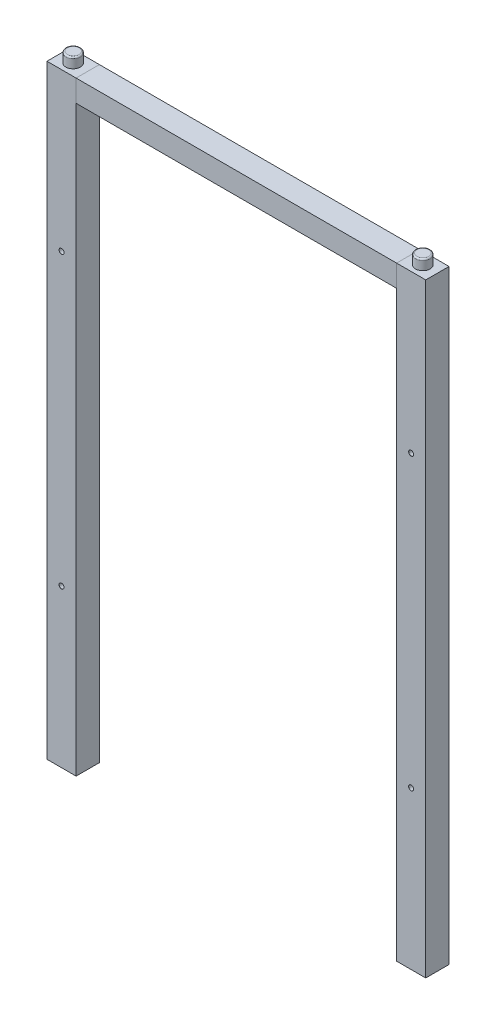
ISO-10303-21;
HEADER;
FILE_DESCRIPTION(('STEP AP214'),'2;1');
FILE_NAME('part.step','',(''),(''),'','','');
FILE_SCHEMA(('AUTOMOTIVE_DESIGN { 1 0 10303 214 1 1 1 1 }'));
ENDSEC;
DATA;
#1=APPLICATION_CONTEXT('core data for automotive mechanical design processes');
#2=APPLICATION_PROTOCOL_DEFINITION('international standard','automotive_design',2000,#1);
#3=PRODUCT_CONTEXT('',#1,'mechanical');
#4=PRODUCT('Part','Part','',(#3));
#5=PRODUCT_RELATED_PRODUCT_CATEGORY('part','',(#4));
#6=PRODUCT_DEFINITION_FORMATION('','',#4);
#7=PRODUCT_DEFINITION_CONTEXT('part definition',#1,'design');
#8=PRODUCT_DEFINITION('design','',#6,#7);
#9=PRODUCT_DEFINITION_SHAPE('','',#8);
#10=(LENGTH_UNIT() NAMED_UNIT(*) SI_UNIT(.MILLI.,.METRE.));
#11=(NAMED_UNIT(*) PLANE_ANGLE_UNIT() SI_UNIT($,.RADIAN.));
#12=(NAMED_UNIT(*) SI_UNIT($,.STERADIAN.) SOLID_ANGLE_UNIT());
#13=UNCERTAINTY_MEASURE_WITH_UNIT(LENGTH_MEASURE(1.E-05),#10,'distance_accuracy_value','');
#14=(GEOMETRIC_REPRESENTATION_CONTEXT(3) GLOBAL_UNCERTAINTY_ASSIGNED_CONTEXT((#13)) GLOBAL_UNIT_ASSIGNED_CONTEXT((#10,
#11,#12)) REPRESENTATION_CONTEXT('',''));
#15=CARTESIAN_POINT('',(0.,0.,0.));
#16=DIRECTION('',(0.,0.,1.));
#17=DIRECTION('',(1.,0.,0.));
#18=AXIS2_PLACEMENT_3D('',#15,#16,#17);
#19=CARTESIAN_POINT('',(0.,182.201851851852,-16.));
#20=DIRECTION('',(-1.,0.,0.));
#21=DIRECTION('',(0.,-1.,0.));
#22=AXIS2_PLACEMENT_3D('',#19,#20,#21);
#23=PLANE('',#22);
#24=DIRECTION('',(0.,-1.,0.));
#25=VECTOR('',#24,1.);
#26=CARTESIAN_POINT('',(0.,182.201851851852,0.));
#27=LINE('',#26,#25);
#28=CARTESIAN_POINT('',(0.,197.201851851852,0.));
#29=VERTEX_POINT('',#28);
#30=CARTESIAN_POINT('',(0.,182.201851851852,0.));
#31=VERTEX_POINT('',#30);
#32=EDGE_CURVE('E116',#29,#31,#27,.T.);
#33=ORIENTED_EDGE('',*,*,#32,.F.);
#34=DIRECTION('',(0.,0.,1.));
#35=VECTOR('',#34,1.);
#36=CARTESIAN_POINT('',(0.,197.201851851852,-16.));
#37=LINE('',#36,#35);
#38=CARTESIAN_POINT('',(0.,197.201851851852,-16.));
#39=VERTEX_POINT('',#38);
#40=EDGE_CURVE('E12',#39,#29,#37,.T.);
#41=ORIENTED_EDGE('',*,*,#40,.F.);
#42=DIRECTION('',(0.,-1.,0.));
#43=VECTOR('',#42,1.);
#44=CARTESIAN_POINT('',(0.,182.201851851852,-16.));
#45=LINE('',#44,#43);
#46=CARTESIAN_POINT('',(0.,182.201851851852,-16.));
#47=VERTEX_POINT('',#46);
#48=EDGE_CURVE('E110',#39,#47,#45,.T.);
#49=ORIENTED_EDGE('',*,*,#48,.T.);
#50=DIRECTION('',(0.,0.,1.));
#51=VECTOR('',#50,1.);
#52=CARTESIAN_POINT('',(0.,182.201851851852,-16.));
#53=LINE('',#52,#51);
#54=EDGE_CURVE('E55',#47,#31,#53,.T.);
#55=ORIENTED_EDGE('',*,*,#54,.T.);
#56=EDGE_LOOP('',(#33,#41,#49,#55));
#57=FACE_BOUND('',#56,.T.);
#58=ADVANCED_FACE('F52',(#57),#23,.T.);
#59=CARTESIAN_POINT('',(0.,197.201851851852,-16.));
#60=DIRECTION('',(0.,1.,0.));
#61=DIRECTION('',(0.,0.,1.));
#62=AXIS2_PLACEMENT_3D('',#59,#60,#61);
#63=PLANE('',#62);
#64=DIRECTION('',(-1.,0.,0.));
#65=VECTOR('',#64,1.);
#66=CARTESIAN_POINT('',(0.,197.201851851852,0.));
#67=LINE('',#66,#65);
#68=CARTESIAN_POINT('',(220.,197.201851851852,0.));
#69=VERTEX_POINT('',#68);
#70=EDGE_CURVE('E112',#69,#29,#67,.T.);
#71=ORIENTED_EDGE('',*,*,#70,.F.);
#72=DIRECTION('',(0.,0.,1.));
#73=VECTOR('',#72,1.);
#74=CARTESIAN_POINT('',(220.,197.201851851852,-16.));
#75=LINE('',#74,#73);
#76=CARTESIAN_POINT('',(220.,197.201851851852,-16.));
#77=VERTEX_POINT('',#76);
#78=EDGE_CURVE('E61',#77,#69,#75,.T.);
#79=ORIENTED_EDGE('',*,*,#78,.F.);
#80=DIRECTION('',(-1.,0.,0.));
#81=VECTOR('',#80,1.);
#82=CARTESIAN_POINT('',(0.,197.201851851852,-16.));
#83=LINE('',#82,#81);
#84=EDGE_CURVE('E107',#77,#39,#83,.T.);
#85=ORIENTED_EDGE('',*,*,#84,.T.);
#86=ORIENTED_EDGE('',*,*,#40,.T.);
#87=EDGE_LOOP('',(#71,#79,#85,#86));
#88=FACE_BOUND('',#87,.T.);
#89=ADVANCED_FACE('F126',(#88),#63,.T.);
#90=CARTESIAN_POINT('',(220.,197.201851851852,-16.));
#91=DIRECTION('',(1.,0.,0.));
#92=DIRECTION('',(0.,0.,-1.));
#93=AXIS2_PLACEMENT_3D('',#90,#91,#92);
#94=PLANE('',#93);
#95=DIRECTION('',(0.,1.,0.));
#96=VECTOR('',#95,1.);
#97=CARTESIAN_POINT('',(220.,197.201851851852,0.));
#98=LINE('',#97,#96);
#99=CARTESIAN_POINT('',(220.,182.201851851852,0.));
#100=VERTEX_POINT('',#99);
#101=EDGE_CURVE('E102',#100,#69,#98,.T.);
#102=ORIENTED_EDGE('',*,*,#101,.F.);
#103=DIRECTION('',(0.,0.,1.));
#104=VECTOR('',#103,1.);
#105=CARTESIAN_POINT('',(220.,182.201851851852,-16.));
#106=LINE('',#105,#104);
#107=CARTESIAN_POINT('',(220.,182.201851851852,-16.));
#108=VERTEX_POINT('',#107);
#109=EDGE_CURVE('E97',#108,#100,#106,.T.);
#110=ORIENTED_EDGE('',*,*,#109,.F.);
#111=DIRECTION('',(0.,1.,0.));
#112=VECTOR('',#111,1.);
#113=CARTESIAN_POINT('',(220.,197.201851851852,-16.));
#114=LINE('',#113,#112);
#115=EDGE_CURVE('E100',#108,#77,#114,.T.);
#116=ORIENTED_EDGE('',*,*,#115,.T.);
#117=ORIENTED_EDGE('',*,*,#78,.T.);
#118=EDGE_LOOP('',(#102,#110,#116,#117));
#119=FACE_BOUND('',#118,.T.);
#120=ADVANCED_FACE('F99',(#119),#94,.T.);
#121=CARTESIAN_POINT('',(220.,182.201851851852,-16.));
#122=DIRECTION('',(0.,-1.,0.));
#123=DIRECTION('',(1.,0.,0.));
#124=AXIS2_PLACEMENT_3D('',#121,#122,#123);
#125=PLANE('',#124);
#126=DIRECTION('',(1.,0.,0.));
#127=VECTOR('',#126,1.);
#128=CARTESIAN_POINT('',(220.,182.201851851852,0.));
#129=LINE('',#128,#127);
#130=EDGE_CURVE('E119',#31,#100,#129,.T.);
#131=ORIENTED_EDGE('',*,*,#130,.F.);
#132=ORIENTED_EDGE('',*,*,#54,.F.);
#133=DIRECTION('',(1.,0.,0.));
#134=VECTOR('',#133,1.);
#135=CARTESIAN_POINT('',(220.,182.201851851852,-16.));
#136=LINE('',#135,#134);
#137=EDGE_CURVE('E106',#47,#108,#136,.T.);
#138=ORIENTED_EDGE('',*,*,#137,.T.);
#139=ORIENTED_EDGE('',*,*,#109,.T.);
#140=EDGE_LOOP('',(#131,#132,#138,#139));
#141=FACE_BOUND('',#140,.T.);
#142=ADVANCED_FACE('F109',(#141),#125,.T.);
#143=CARTESIAN_POINT('',(0.,0.,-16.));
#144=DIRECTION('',(0.,0.,-1.));
#145=DIRECTION('',(-1.,0.,0.));
#146=AXIS2_PLACEMENT_3D('',#143,#144,#145);
#147=PLANE('',#146);
#148=ORIENTED_EDGE('',*,*,#48,.F.);
#149=ORIENTED_EDGE('',*,*,#84,.F.);
#150=ORIENTED_EDGE('',*,*,#115,.F.);
#151=ORIENTED_EDGE('',*,*,#137,.F.);
#152=EDGE_LOOP('',(#148,#149,#150,#151));
#153=FACE_BOUND('',#152,.T.);
#154=ADVANCED_FACE('F105',(#153),#147,.T.);
#155=CARTESIAN_POINT('',(0.,0.,0.));
#156=DIRECTION('',(0.,0.,-1.));
#157=DIRECTION('',(-1.,0.,0.));
#158=AXIS2_PLACEMENT_3D('',#155,#156,#157);
#159=PLANE('',#158);
#160=ORIENTED_EDGE('',*,*,#32,.T.);
#161=ORIENTED_EDGE('',*,*,#130,.T.);
#162=ORIENTED_EDGE('',*,*,#101,.T.);
#163=ORIENTED_EDGE('',*,*,#70,.T.);
#164=EDGE_LOOP('',(#160,#161,#162,#163));
#165=FACE_BOUND('',#164,.T.);
#166=ADVANCED_FACE('F125',(#165),#159,.F.);
#167=CLOSED_SHELL('',(#58,#89,#120,#142,#154,#166));
#168=MANIFOLD_SOLID_BREP('B2',#167);
#169=CARTESIAN_POINT('',(240.,197.201851851852,-15.9999999999982));
#170=DIRECTION('',(0.,1.,0.));
#171=DIRECTION('',(0.,0.,1.));
#172=AXIS2_PLACEMENT_3D('',#169,#170,#171);
#173=PLANE('',#172);
#174=CARTESIAN_POINT('',(230.,197.201851851852,-7.99999999999832));
#175=DIRECTION('',(0.,-1.,0.));
#176=DIRECTION('',(0.,0.,1.));
#177=AXIS2_PLACEMENT_3D('',#174,#175,#176);
#178=CIRCLE('',#177,5.);
#179=CARTESIAN_POINT('',(230.,197.201851851852,-2.99999999999832));
#180=VERTEX_POINT('',#179);
#181=EDGE_CURVE('E316',#180,#180,#178,.T.);
#182=ORIENTED_EDGE('',*,*,#181,.T.);
#183=EDGE_LOOP('',(#182));
#184=FACE_BOUND('',#183,.T.);
#185=DIRECTION('',(0.,0.,1.));
#186=VECTOR('',#185,1.);
#187=CARTESIAN_POINT('',(220.,197.201851851852,-15.9999999999985));
#188=LINE('',#187,#186);
#189=CARTESIAN_POINT('',(220.,197.201851851852,-15.9999999999985));
#190=VERTEX_POINT('',#189);
#191=CARTESIAN_POINT('',(220.,197.201851851852,1.53625178909098E-12));
#192=VERTEX_POINT('',#191);
#193=EDGE_CURVE('E315',#190,#192,#188,.T.);
#194=ORIENTED_EDGE('',*,*,#193,.T.);
#195=DIRECTION('',(-1.,0.,0.));
#196=VECTOR('',#195,1.);
#197=CARTESIAN_POINT('',(240.,197.201851851852,1.81557029619843E-12));
#198=LINE('',#197,#196);
#199=CARTESIAN_POINT('',(240.,197.201851851852,1.81557029619843E-12));
#200=VERTEX_POINT('',#199);
#201=EDGE_CURVE('E326',#200,#192,#198,.T.);
#202=ORIENTED_EDGE('',*,*,#201,.F.);
#203=DIRECTION('',(0.,0.,1.));
#204=VECTOR('',#203,1.);
#205=CARTESIAN_POINT('',(240.,197.201851851852,-15.9999999999982));
#206=LINE('',#205,#204);
#207=CARTESIAN_POINT('',(240.,197.201851851852,-15.9999999999982));
#208=VERTEX_POINT('',#207);
#209=EDGE_CURVE('E320',#208,#200,#206,.T.);
#210=ORIENTED_EDGE('',*,*,#209,.F.);
#211=DIRECTION('',(-1.,0.,0.));
#212=VECTOR('',#211,1.);
#213=CARTESIAN_POINT('',(240.,197.201851851852,-15.9999999999982));
#214=LINE('',#213,#212);
#215=EDGE_CURVE('E319',#208,#190,#214,.T.);
#216=ORIENTED_EDGE('',*,*,#215,.T.);
#217=EDGE_LOOP('',(#194,#202,#210,#216));
#218=FACE_BOUND('',#217,.T.);
#219=ADVANCED_FACE('F185',(#184,#218),#173,.T.);
#220=CARTESIAN_POINT('',(240.,-217.798148148148,-15.9999999999982));
#221=DIRECTION('',(0.,0.,-1.));
#222=DIRECTION('',(1.,0.,0.));
#223=AXIS2_PLACEMENT_3D('',#220,#221,#222);
#224=PLANE('',#223);
#225=CARTESIAN_POINT('',(230.,89.2018518518519,-15.9999999999983));
#226=DIRECTION('',(0.,0.,-1.));
#227=DIRECTION('',(-1.,0.,0.));
#228=AXIS2_PLACEMENT_3D('',#225,#226,#227);
#229=CIRCLE('',#228,1.7);
#230=CARTESIAN_POINT('',(228.3,89.2018518518519,-15.9999999999983));
#231=VERTEX_POINT('',#230);
#232=EDGE_CURVE('E303',#231,#231,#229,.T.);
#233=ORIENTED_EDGE('',*,*,#232,.F.);
#234=EDGE_LOOP('',(#233));
#235=FACE_BOUND('',#234,.T.);
#236=CARTESIAN_POINT('',(230.,-109.798148148148,-15.9999999999983));
#237=DIRECTION('',(0.,0.,-1.));
#238=DIRECTION('',(-1.,0.,0.));
#239=AXIS2_PLACEMENT_3D('',#236,#237,#238);
#240=CIRCLE('',#239,1.7);
#241=CARTESIAN_POINT('',(228.3,-109.798148148148,-15.9999999999983));
#242=VERTEX_POINT('',#241);
#243=EDGE_CURVE('E312',#242,#242,#240,.T.);
#244=ORIENTED_EDGE('',*,*,#243,.F.);
#245=EDGE_LOOP('',(#244));
#246=FACE_BOUND('',#245,.T.);
#247=DIRECTION('',(0.,1.,0.));
#248=VECTOR('',#247,1.);
#249=CARTESIAN_POINT('',(220.,-217.798148148148,-15.9999999999985));
#250=LINE('',#249,#248);
#251=CARTESIAN_POINT('',(220.,-217.798148148148,-15.9999999999985));
#252=VERTEX_POINT('',#251);
#253=EDGE_CURVE('E230',#252,#190,#250,.T.);
#254=ORIENTED_EDGE('',*,*,#253,.T.);
#255=ORIENTED_EDGE('',*,*,#215,.F.);
#256=DIRECTION('',(0.,1.,0.));
#257=VECTOR('',#256,1.);
#258=CARTESIAN_POINT('',(240.,-217.798148148148,-15.9999999999982));
#259=LINE('',#258,#257);
#260=CARTESIAN_POINT('',(240.,-217.798148148148,-15.9999999999982));
#261=VERTEX_POINT('',#260);
#262=EDGE_CURVE('E209',#261,#208,#259,.T.);
#263=ORIENTED_EDGE('',*,*,#262,.F.);
#264=DIRECTION('',(-1.,0.,0.));
#265=VECTOR('',#264,1.);
#266=CARTESIAN_POINT('',(240.,-217.798148148148,-15.9999999999982));
#267=LINE('',#266,#265);
#268=EDGE_CURVE('E335',#261,#252,#267,.T.);
#269=ORIENTED_EDGE('',*,*,#268,.T.);
#270=EDGE_LOOP('',(#254,#255,#263,#269));
#271=FACE_BOUND('',#270,.T.);
#272=ADVANCED_FACE('F359',(#235,#246,#271),#224,.T.);
#273=CARTESIAN_POINT('',(240.,-217.798148148148,1.81557029619843E-12));
#274=DIRECTION('',(0.,-1.,0.));
#275=DIRECTION('',(0.,0.,-1.));
#276=AXIS2_PLACEMENT_3D('',#273,#274,#275);
#277=PLANE('',#276);
#278=DIRECTION('',(0.,0.,-1.));
#279=VECTOR('',#278,1.);
#280=CARTESIAN_POINT('',(237.5,-217.798148148148,-0.499999999998219));
#281=LINE('',#280,#279);
#282=CARTESIAN_POINT('',(237.5,-217.798148148148,-0.499999999998219));
#283=VERTEX_POINT('',#282);
#284=CARTESIAN_POINT('',(237.5,-217.798148148148,-15.4999999999982));
#285=VERTEX_POINT('',#284);
#286=EDGE_CURVE('E288',#283,#285,#281,.T.);
#287=ORIENTED_EDGE('',*,*,#286,.T.);
#288=DIRECTION('',(-1.,0.,0.));
#289=VECTOR('',#288,1.);
#290=CARTESIAN_POINT('',(237.5,-217.798148148148,-15.4999999999982));
#291=LINE('',#290,#289);
#292=CARTESIAN_POINT('',(222.5,-217.798148148148,-15.4999999999984));
#293=VERTEX_POINT('',#292);
#294=EDGE_CURVE('E273',#285,#293,#291,.T.);
#295=ORIENTED_EDGE('',*,*,#294,.T.);
#296=DIRECTION('',(0.,0.,1.));
#297=VECTOR('',#296,1.);
#298=CARTESIAN_POINT('',(222.5,-217.798148148148,-0.499999999998429));
#299=LINE('',#298,#297);
#300=CARTESIAN_POINT('',(222.5,-217.798148148148,-0.499999999998429));
#301=VERTEX_POINT('',#300);
#302=EDGE_CURVE('E283',#293,#301,#299,.T.);
#303=ORIENTED_EDGE('',*,*,#302,.T.);
#304=DIRECTION('',(1.,0.,0.));
#305=VECTOR('',#304,1.);
#306=CARTESIAN_POINT('',(237.5,-217.798148148148,-0.499999999998219));
#307=LINE('',#306,#305);
#308=EDGE_CURVE('E280',#301,#283,#307,.T.);
#309=ORIENTED_EDGE('',*,*,#308,.T.);
#310=EDGE_LOOP('',(#287,#295,#303,#309));
#311=FACE_BOUND('',#310,.T.);
#312=DIRECTION('',(0.,0.,-1.));
#313=VECTOR('',#312,1.);
#314=CARTESIAN_POINT('',(220.,-217.798148148148,1.53625178909098E-12));
#315=LINE('',#314,#313);
#316=CARTESIAN_POINT('',(220.,-217.798148148148,1.53625178909098E-12));
#317=VERTEX_POINT('',#316);
#318=EDGE_CURVE('E331',#317,#252,#315,.T.);
#319=ORIENTED_EDGE('',*,*,#318,.T.);
#320=ORIENTED_EDGE('',*,*,#268,.F.);
#321=DIRECTION('',(0.,0.,-1.));
#322=VECTOR('',#321,1.);
#323=CARTESIAN_POINT('',(240.,-217.798148148148,1.81557029619843E-12));
#324=LINE('',#323,#322);
#325=CARTESIAN_POINT('',(240.,-217.798148148148,1.81557029619843E-12));
#326=VERTEX_POINT('',#325);
#327=EDGE_CURVE('E323',#326,#261,#324,.T.);
#328=ORIENTED_EDGE('',*,*,#327,.F.);
#329=DIRECTION('',(-1.,0.,0.));
#330=VECTOR('',#329,1.);
#331=CARTESIAN_POINT('',(240.,-217.798148148148,1.81557029619843E-12));
#332=LINE('',#331,#330);
#333=EDGE_CURVE('E337',#326,#317,#332,.T.);
#334=ORIENTED_EDGE('',*,*,#333,.T.);
#335=EDGE_LOOP('',(#319,#320,#328,#334));
#336=FACE_BOUND('',#335,.T.);
#337=ADVANCED_FACE('F364',(#311,#336),#277,.T.);
#338=CARTESIAN_POINT('',(240.,197.201851851852,1.81557029619843E-12));
#339=DIRECTION('',(0.,0.,1.));
#340=DIRECTION('',(-1.,0.,0.));
#341=AXIS2_PLACEMENT_3D('',#338,#339,#340);
#342=PLANE('',#341);
#343=CARTESIAN_POINT('',(230.,89.2018518518519,1.67764576612068E-12));
#344=DIRECTION('',(0.,0.,-1.));
#345=DIRECTION('',(-1.,0.,0.));
#346=AXIS2_PLACEMENT_3D('',#343,#344,#345);
#347=CIRCLE('',#346,1.725);
#348=CARTESIAN_POINT('',(228.275,89.2018518518519,1.65355454488266E-12));
#349=VERTEX_POINT('',#348);
#350=EDGE_CURVE('E294',#349,#349,#347,.T.);
#351=ORIENTED_EDGE('',*,*,#350,.T.);
#352=EDGE_LOOP('',(#351));
#353=FACE_BOUND('',#352,.T.);
#354=CARTESIAN_POINT('',(230.,-109.798148148148,1.67764576612068E-12));
#355=DIRECTION('',(0.,0.,-1.));
#356=DIRECTION('',(-1.,0.,0.));
#357=AXIS2_PLACEMENT_3D('',#354,#355,#356);
#358=CIRCLE('',#357,1.725);
#359=CARTESIAN_POINT('',(228.275,-109.798148148148,1.65355454488266E-12));
#360=VERTEX_POINT('',#359);
#361=EDGE_CURVE('E306',#360,#360,#358,.T.);
#362=ORIENTED_EDGE('',*,*,#361,.T.);
#363=EDGE_LOOP('',(#362));
#364=FACE_BOUND('',#363,.T.);
#365=DIRECTION('',(0.,-1.,0.));
#366=VECTOR('',#365,1.);
#367=CARTESIAN_POINT('',(220.,197.201851851852,1.53625178909098E-12));
#368=LINE('',#367,#366);
#369=EDGE_CURVE('E329',#192,#317,#368,.T.);
#370=ORIENTED_EDGE('',*,*,#369,.T.);
#371=ORIENTED_EDGE('',*,*,#333,.F.);
#372=DIRECTION('',(0.,-1.,0.));
#373=VECTOR('',#372,1.);
#374=CARTESIAN_POINT('',(240.,197.201851851852,1.81557029619843E-12));
#375=LINE('',#374,#373);
#376=EDGE_CURVE('E238',#200,#326,#375,.T.);
#377=ORIENTED_EDGE('',*,*,#376,.F.);
#378=ORIENTED_EDGE('',*,*,#201,.T.);
#379=EDGE_LOOP('',(#370,#371,#377,#378));
#380=FACE_BOUND('',#379,.T.);
#381=ADVANCED_FACE('F369',(#353,#364,#380),#342,.T.);
#382=CARTESIAN_POINT('',(240.,0.,1.81557029619843E-12));
#383=DIRECTION('',(-1.,0.,0.));
#384=DIRECTION('',(0.,0.,-1.));
#385=AXIS2_PLACEMENT_3D('',#382,#383,#384);
#386=PLANE('',#385);
#387=ORIENTED_EDGE('',*,*,#209,.T.);
#388=ORIENTED_EDGE('',*,*,#376,.T.);
#389=ORIENTED_EDGE('',*,*,#327,.T.);
#390=ORIENTED_EDGE('',*,*,#262,.T.);
#391=EDGE_LOOP('',(#387,#388,#389,#390));
#392=FACE_BOUND('',#391,.T.);
#393=ADVANCED_FACE('F372',(#392),#386,.F.);
#394=CARTESIAN_POINT('',(220.,0.,1.53625178909098E-12));
#395=DIRECTION('',(-1.,0.,0.));
#396=DIRECTION('',(0.,0.,-1.));
#397=AXIS2_PLACEMENT_3D('',#394,#395,#396);
#398=PLANE('',#397);
#399=ORIENTED_EDGE('',*,*,#193,.F.);
#400=ORIENTED_EDGE('',*,*,#253,.F.);
#401=ORIENTED_EDGE('',*,*,#318,.F.);
#402=ORIENTED_EDGE('',*,*,#369,.F.);
#403=EDGE_LOOP('',(#399,#400,#401,#402));
#404=FACE_BOUND('',#403,.T.);
#405=ADVANCED_FACE('F354',(#404),#398,.T.);
#406=CARTESIAN_POINT('',(230.,204.201851851852,-7.99999999999832));
#407=DIRECTION('',(0.,-1.,0.));
#408=DIRECTION('',(0.,0.,-1.));
#409=AXIS2_PLACEMENT_3D('',#406,#407,#408);
#410=CYLINDRICAL_SURFACE('',#409,5.);
#411=CARTESIAN_POINT('',(230.,203.201851851852,-7.99999999999832));
#412=DIRECTION('',(0.,-1.,0.));
#413=DIRECTION('',(0.,0.,1.));
#414=AXIS2_PLACEMENT_3D('',#411,#412,#413);
#415=CIRCLE('',#414,5.);
#416=CARTESIAN_POINT('',(230.,203.201851851852,-2.99999999999832));
#417=VERTEX_POINT('',#416);
#418=EDGE_CURVE('E50',#417,#417,#415,.F.);
#419=ORIENTED_EDGE('',*,*,#418,.F.);
#420=EDGE_LOOP('',(#419));
#421=FACE_BOUND('',#420,.T.);
#422=ORIENTED_EDGE('',*,*,#181,.F.);
#423=EDGE_LOOP('',(#422));
#424=FACE_BOUND('',#423,.T.);
#425=ADVANCED_FACE('F346',(#421,#424),#410,.T.);
#426=CARTESIAN_POINT('',(230.,204.201851851852,-7.99999999999832));
#427=DIRECTION('',(0.,1.,0.));
#428=DIRECTION('',(0.,0.,1.));
#429=AXIS2_PLACEMENT_3D('',#426,#427,#428);
#430=PLANE('',#429);
#431=CARTESIAN_POINT('',(230.,204.201851851852,-7.99999999999832));
#432=DIRECTION('',(0.,-1.,0.));
#433=DIRECTION('',(0.,0.,1.));
#434=AXIS2_PLACEMENT_3D('',#431,#432,#433);
#435=CIRCLE('',#434,4.);
#436=CARTESIAN_POINT('',(230.,204.201851851852,-3.99999999999832));
#437=VERTEX_POINT('',#436);
#438=EDGE_CURVE('E193',#437,#437,#435,.T.);
#439=ORIENTED_EDGE('',*,*,#438,.F.);
#440=EDGE_LOOP('',(#439));
#441=FACE_BOUND('',#440,.T.);
#442=ADVANCED_FACE('F344',(#441),#430,.T.);
#443=CARTESIAN_POINT('',(230.,203.201851851852,-7.99999999999832));
#444=DIRECTION('',(0.,1.,0.));
#445=DIRECTION('',(0.,0.,1.));
#446=AXIS2_PLACEMENT_3D('',#443,#444,#445);
#447=TOROIDAL_SURFACE('',#446,4.,1.);
#448=ORIENTED_EDGE('',*,*,#418,.T.);
#449=EDGE_LOOP('',(#448));
#450=FACE_BOUND('',#449,.T.);
#451=ORIENTED_EDGE('',*,*,#438,.T.);
#452=EDGE_LOOP('',(#451));
#453=FACE_BOUND('',#452,.T.);
#454=ADVANCED_FACE('F187',(#450,#453),#447,.T.);
#455=CARTESIAN_POINT('',(230.,-109.798148148148,1.6759110426447E-12));
#456=DIRECTION('',(0.,0.,1.));
#457=DIRECTION('',(-1.,0.,0.));
#458=AXIS2_PLACEMENT_3D('',#455,#456,#457);
#459=CYLINDRICAL_SURFACE('',#458,1.7);
#460=ORIENTED_EDGE('',*,*,#243,.T.);
#461=EDGE_LOOP('',(#460));
#462=FACE_BOUND('',#461,.T.);
#463=CARTESIAN_POINT('',(230.,-109.798148148148,-0.0249999999983248));
#464=DIRECTION('',(0.,0.,-1.));
#465=DIRECTION('',(-1.,0.,0.));
#466=AXIS2_PLACEMENT_3D('',#463,#464,#465);
#467=CIRCLE('',#466,1.7);
#468=CARTESIAN_POINT('',(228.3,-109.798148148148,-0.0249999999983485));
#469=VERTEX_POINT('',#468);
#470=EDGE_CURVE('E309',#469,#469,#467,.T.);
#471=ORIENTED_EDGE('',*,*,#470,.F.);
#472=EDGE_LOOP('',(#471));
#473=FACE_BOUND('',#472,.T.);
#474=ADVANCED_FACE('F352',(#462,#473),#459,.F.);
#475=CARTESIAN_POINT('',(230.,-109.798148148148,1.67764576612068E-12));
#476=DIRECTION('',(0.,0.,1.));
#477=DIRECTION('',(-1.,0.,0.));
#478=AXIS2_PLACEMENT_3D('',#475,#476,#477);
#479=CONICAL_SURFACE('',#478,1.725,0.785398163397448);
#480=ORIENTED_EDGE('',*,*,#470,.T.);
#481=EDGE_LOOP('',(#480));
#482=FACE_BOUND('',#481,.T.);
#483=ORIENTED_EDGE('',*,*,#361,.F.);
#484=EDGE_LOOP('',(#483));
#485=FACE_BOUND('',#484,.T.);
#486=ADVANCED_FACE('F419',(#482,#485),#479,.F.);
#487=CARTESIAN_POINT('',(230.,89.2018518518519,1.6759110426447E-12));
#488=DIRECTION('',(0.,0.,1.));
#489=DIRECTION('',(-1.,0.,0.));
#490=AXIS2_PLACEMENT_3D('',#487,#488,#489);
#491=CYLINDRICAL_SURFACE('',#490,1.7);
#492=ORIENTED_EDGE('',*,*,#232,.T.);
#493=EDGE_LOOP('',(#492));
#494=FACE_BOUND('',#493,.T.);
#495=CARTESIAN_POINT('',(230.,89.2018518518519,-0.0249999999983248));
#496=DIRECTION('',(0.,0.,-1.));
#497=DIRECTION('',(-1.,0.,0.));
#498=AXIS2_PLACEMENT_3D('',#495,#496,#497);
#499=CIRCLE('',#498,1.7);
#500=CARTESIAN_POINT('',(228.3,89.2018518518519,-0.0249999999983485));
#501=VERTEX_POINT('',#500);
#502=EDGE_CURVE('E300',#501,#501,#499,.T.);
#503=ORIENTED_EDGE('',*,*,#502,.F.);
#504=EDGE_LOOP('',(#503));
#505=FACE_BOUND('',#504,.T.);
#506=ADVANCED_FACE('F428',(#494,#505),#491,.F.);
#507=CARTESIAN_POINT('',(230.,89.2018518518519,1.67764576612068E-12));
#508=DIRECTION('',(0.,0.,1.));
#509=DIRECTION('',(-1.,0.,0.));
#510=AXIS2_PLACEMENT_3D('',#507,#508,#509);
#511=CONICAL_SURFACE('',#510,1.725,0.785398163397448);
#512=ORIENTED_EDGE('',*,*,#502,.T.);
#513=EDGE_LOOP('',(#512));
#514=FACE_BOUND('',#513,.T.);
#515=ORIENTED_EDGE('',*,*,#350,.F.);
#516=EDGE_LOOP('',(#515));
#517=FACE_BOUND('',#516,.T.);
#518=ADVANCED_FACE('F438',(#514,#517),#511,.F.);
#519=CARTESIAN_POINT('',(237.5,-210.798148148148,-0.499999999998207));
#520=DIRECTION('',(1.,0.,0.));
#521=DIRECTION('',(0.,0.,1.));
#522=AXIS2_PLACEMENT_3D('',#519,#520,#521);
#523=PLANE('',#522);
#524=ORIENTED_EDGE('',*,*,#286,.F.);
#525=DIRECTION('',(0.,-1.,0.));
#526=VECTOR('',#525,1.);
#527=CARTESIAN_POINT('',(237.5,-210.798148148148,-0.499999999998207));
#528=LINE('',#527,#526);
#529=CARTESIAN_POINT('',(237.5,-210.798148148148,-0.499999999998207));
#530=VERTEX_POINT('',#529);
#531=EDGE_CURVE('E279',#530,#283,#528,.T.);
#532=ORIENTED_EDGE('',*,*,#531,.F.);
#533=DIRECTION('',(0.,0.,-1.));
#534=VECTOR('',#533,1.);
#535=CARTESIAN_POINT('',(237.5,-210.798148148148,-0.499999999998207));
#536=LINE('',#535,#534);
#537=CARTESIAN_POINT('',(237.5,-210.798148148148,-15.4999999999982));
#538=VERTEX_POINT('',#537);
#539=EDGE_CURVE('E265',#530,#538,#536,.T.);
#540=ORIENTED_EDGE('',*,*,#539,.T.);
#541=DIRECTION('',(0.,-1.,0.));
#542=VECTOR('',#541,1.);
#543=CARTESIAN_POINT('',(237.5,-210.798148148148,-15.4999999999982));
#544=LINE('',#543,#542);
#545=EDGE_CURVE('E200',#538,#285,#544,.T.);
#546=ORIENTED_EDGE('',*,*,#545,.T.);
#547=EDGE_LOOP('',(#524,#532,#540,#546));
#548=FACE_BOUND('',#547,.T.);
#549=ADVANCED_FACE('F278',(#548),#523,.F.);
#550=CARTESIAN_POINT('',(237.5,-210.798148148148,-0.499999999998207));
#551=DIRECTION('',(0.,0.,1.));
#552=DIRECTION('',(0.,-1.,0.));
#553=AXIS2_PLACEMENT_3D('',#550,#551,#552);
#554=PLANE('',#553);
#555=ORIENTED_EDGE('',*,*,#308,.F.);
#556=DIRECTION('',(0.,-1.,0.));
#557=VECTOR('',#556,1.);
#558=CARTESIAN_POINT('',(222.5,-210.798148148148,-0.499999999998417));
#559=LINE('',#558,#557);
#560=CARTESIAN_POINT('',(222.5,-210.798148148148,-0.499999999998417));
#561=VERTEX_POINT('',#560);
#562=EDGE_CURVE('E295',#561,#301,#559,.T.);
#563=ORIENTED_EDGE('',*,*,#562,.F.);
#564=DIRECTION('',(1.,0.,0.));
#565=VECTOR('',#564,1.);
#566=CARTESIAN_POINT('',(237.5,-210.798148148148,-0.499999999998207));
#567=LINE('',#566,#565);
#568=EDGE_CURVE('E276',#561,#530,#567,.T.);
#569=ORIENTED_EDGE('',*,*,#568,.T.);
#570=ORIENTED_EDGE('',*,*,#531,.T.);
#571=EDGE_LOOP('',(#555,#563,#569,#570));
#572=FACE_BOUND('',#571,.T.);
#573=ADVANCED_FACE('F457',(#572),#554,.F.);
#574=CARTESIAN_POINT('',(222.5,-210.798148148148,-0.499999999998417));
#575=DIRECTION('',(-1.,0.,0.));
#576=DIRECTION('',(0.,0.,-1.));
#577=AXIS2_PLACEMENT_3D('',#574,#575,#576);
#578=PLANE('',#577);
#579=ORIENTED_EDGE('',*,*,#302,.F.);
#580=DIRECTION('',(0.,-1.,0.));
#581=VECTOR('',#580,1.);
#582=CARTESIAN_POINT('',(222.5,-210.798148148148,-15.4999999999984));
#583=LINE('',#582,#581);
#584=CARTESIAN_POINT('',(222.5,-210.798148148148,-15.4999999999984));
#585=VERTEX_POINT('',#584);
#586=EDGE_CURVE('E275',#585,#293,#583,.T.);
#587=ORIENTED_EDGE('',*,*,#586,.F.);
#588=DIRECTION('',(0.,0.,1.));
#589=VECTOR('',#588,1.);
#590=CARTESIAN_POINT('',(222.5,-210.798148148148,-0.499999999998417));
#591=LINE('',#590,#589);
#592=EDGE_CURVE('E267',#585,#561,#591,.T.);
#593=ORIENTED_EDGE('',*,*,#592,.T.);
#594=ORIENTED_EDGE('',*,*,#562,.T.);
#595=EDGE_LOOP('',(#579,#587,#593,#594));
#596=FACE_BOUND('',#595,.T.);
#597=ADVANCED_FACE('F466',(#596),#578,.F.);
#598=CARTESIAN_POINT('',(237.5,-210.798148148148,-15.4999999999982));
#599=DIRECTION('',(0.,0.,-1.));
#600=DIRECTION('',(0.,1.,0.));
#601=AXIS2_PLACEMENT_3D('',#598,#599,#600);
#602=PLANE('',#601);
#603=ORIENTED_EDGE('',*,*,#294,.F.);
#604=ORIENTED_EDGE('',*,*,#545,.F.);
#605=DIRECTION('',(-1.,0.,0.));
#606=VECTOR('',#605,1.);
#607=CARTESIAN_POINT('',(237.5,-210.798148148148,-15.4999999999982));
#608=LINE('',#607,#606);
#609=EDGE_CURVE('E262',#538,#585,#608,.T.);
#610=ORIENTED_EDGE('',*,*,#609,.T.);
#611=ORIENTED_EDGE('',*,*,#586,.T.);
#612=EDGE_LOOP('',(#603,#604,#610,#611));
#613=FACE_BOUND('',#612,.T.);
#614=ADVANCED_FACE('F271',(#613),#602,.F.);
#615=CARTESIAN_POINT('',(220.,-210.798148148148,1.14538732209816E-12));
#616=DIRECTION('',(0.,-1.,0.));
#617=DIRECTION('',(0.,0.,-1.));
#618=AXIS2_PLACEMENT_3D('',#615,#616,#617);
#619=PLANE('',#618);
#620=ORIENTED_EDGE('',*,*,#539,.F.);
#621=ORIENTED_EDGE('',*,*,#568,.F.);
#622=ORIENTED_EDGE('',*,*,#592,.F.);
#623=ORIENTED_EDGE('',*,*,#609,.F.);
#624=EDGE_LOOP('',(#620,#621,#622,#623));
#625=FACE_BOUND('',#624,.T.);
#626=ADVANCED_FACE('F263',(#625),#619,.T.);
#627=CLOSED_SHELL('',(#219,#272,#337,#381,#393,#405,#425,#442,#454,#474,#486,#506,#518,#549,
#573,#597,#614,#626));
#628=MANIFOLD_SOLID_BREP('B6',#627);
#629=CARTESIAN_POINT('',(-20.,197.201851851852,-16.));
#630=DIRECTION('',(0.,1.,0.));
#631=DIRECTION('',(0.,0.,1.));
#632=AXIS2_PLACEMENT_3D('',#629,#630,#631);
#633=PLANE('',#632);
#634=CARTESIAN_POINT('',(-10.,197.201851851852,-8.));
#635=DIRECTION('',(0.,1.,0.));
#636=DIRECTION('',(0.,0.,1.));
#637=AXIS2_PLACEMENT_3D('',#634,#635,#636);
#638=CIRCLE('',#637,5.);
#639=CARTESIAN_POINT('',(-10.,197.201851851852,-3.));
#640=VERTEX_POINT('',#639);
#641=EDGE_CURVE('E691',#640,#640,#638,.T.);
#642=ORIENTED_EDGE('',*,*,#641,.F.);
#643=EDGE_LOOP('',(#642));
#644=FACE_BOUND('',#643,.T.);
#645=DIRECTION('',(0.,0.,1.));
#646=VECTOR('',#645,1.);
#647=CARTESIAN_POINT('',(0.,197.201851851852,-16.));
#648=LINE('',#647,#646);
#649=CARTESIAN_POINT('',(0.,197.201851851852,-16.));
#650=VERTEX_POINT('',#649);
#651=CARTESIAN_POINT('',(0.,197.201851851852,0.));
#652=VERTEX_POINT('',#651);
#653=EDGE_CURVE('E690',#650,#652,#648,.T.);
#654=ORIENTED_EDGE('',*,*,#653,.F.);
#655=DIRECTION('',(1.,0.,0.));
#656=VECTOR('',#655,1.);
#657=CARTESIAN_POINT('',(-20.,197.201851851852,-16.));
#658=LINE('',#657,#656);
#659=CARTESIAN_POINT('',(-20.,197.201851851852,-16.));
#660=VERTEX_POINT('',#659);
#661=EDGE_CURVE('E566',#660,#650,#658,.T.);
#662=ORIENTED_EDGE('',*,*,#661,.F.);
#663=DIRECTION('',(0.,0.,1.));
#664=VECTOR('',#663,1.);
#665=CARTESIAN_POINT('',(-20.,197.201851851852,-16.));
#666=LINE('',#665,#664);
#667=CARTESIAN_POINT('',(-20.,197.201851851852,0.));
#668=VERTEX_POINT('',#667);
#669=EDGE_CURVE('E695',#660,#668,#666,.T.);
#670=ORIENTED_EDGE('',*,*,#669,.T.);
#671=DIRECTION('',(1.,0.,0.));
#672=VECTOR('',#671,1.);
#673=CARTESIAN_POINT('',(-20.,197.201851851852,0.));
#674=LINE('',#673,#672);
#675=EDGE_CURVE('E592',#668,#652,#674,.T.);
#676=ORIENTED_EDGE('',*,*,#675,.T.);
#677=EDGE_LOOP('',(#654,#662,#670,#676));
#678=FACE_BOUND('',#677,.T.);
#679=ADVANCED_FACE('F541',(#644,#678),#633,.T.);
#680=CARTESIAN_POINT('',(-20.,-217.798148148148,-16.));
#681=DIRECTION('',(0.,0.,-1.));
#682=DIRECTION('',(-1.,0.,0.));
#683=AXIS2_PLACEMENT_3D('',#680,#681,#682);
#684=PLANE('',#683);
#685=CARTESIAN_POINT('',(-10.,89.2018518518519,-16.));
#686=DIRECTION('',(0.,0.,1.));
#687=DIRECTION('',(1.,0.,0.));
#688=AXIS2_PLACEMENT_3D('',#685,#686,#687);
#689=CIRCLE('',#688,1.7);
#690=CARTESIAN_POINT('',(-8.3,89.2018518518519,-16.));
#691=VERTEX_POINT('',#690);
#692=EDGE_CURVE('E674',#691,#691,#689,.T.);
#693=ORIENTED_EDGE('',*,*,#692,.T.);
#694=EDGE_LOOP('',(#693));
#695=FACE_BOUND('',#694,.T.);
#696=CARTESIAN_POINT('',(-10.,-109.798148148148,-16.));
#697=DIRECTION('',(0.,0.,1.));
#698=DIRECTION('',(1.,0.,0.));
#699=AXIS2_PLACEMENT_3D('',#696,#697,#698);
#700=CIRCLE('',#699,1.7);
#701=CARTESIAN_POINT('',(-8.3,-109.798148148148,-16.));
#702=VERTEX_POINT('',#701);
#703=EDGE_CURVE('E686',#702,#702,#700,.T.);
#704=ORIENTED_EDGE('',*,*,#703,.T.);
#705=EDGE_LOOP('',(#704));
#706=FACE_BOUND('',#705,.T.);
#707=DIRECTION('',(0.,1.,0.));
#708=VECTOR('',#707,1.);
#709=CARTESIAN_POINT('',(0.,-217.798148148148,-16.));
#710=LINE('',#709,#708);
#711=CARTESIAN_POINT('',(0.,-217.798148148148,-16.));
#712=VERTEX_POINT('',#711);
#713=EDGE_CURVE('E699',#712,#650,#710,.T.);
#714=ORIENTED_EDGE('',*,*,#713,.F.);
#715=DIRECTION('',(1.,0.,0.));
#716=VECTOR('',#715,1.);
#717=CARTESIAN_POINT('',(-20.,-217.798148148148,-16.));
#718=LINE('',#717,#716);
#719=CARTESIAN_POINT('',(-20.,-217.798148148148,-16.));
#720=VERTEX_POINT('',#719);
#721=EDGE_CURVE('E725',#720,#712,#718,.T.);
#722=ORIENTED_EDGE('',*,*,#721,.F.);
#723=DIRECTION('',(0.,1.,0.));
#724=VECTOR('',#723,1.);
#725=CARTESIAN_POINT('',(-20.,-217.798148148148,-16.));
#726=LINE('',#725,#724);
#727=EDGE_CURVE('E706',#720,#660,#726,.T.);
#728=ORIENTED_EDGE('',*,*,#727,.T.);
#729=ORIENTED_EDGE('',*,*,#661,.T.);
#730=EDGE_LOOP('',(#714,#722,#728,#729));
#731=FACE_BOUND('',#730,.T.);
#732=ADVANCED_FACE('F752',(#695,#706,#731),#684,.T.);
#733=CARTESIAN_POINT('',(-20.,-217.798148148148,0.));
#734=DIRECTION('',(0.,-1.,0.));
#735=DIRECTION('',(0.,0.,-1.));
#736=AXIS2_PLACEMENT_3D('',#733,#734,#735);
#737=PLANE('',#736);
#738=DIRECTION('',(0.,0.,-1.));
#739=VECTOR('',#738,1.);
#740=CARTESIAN_POINT('',(-17.5,-217.798148148148,-0.5));
#741=LINE('',#740,#739);
#742=CARTESIAN_POINT('',(-17.5,-217.798148148148,-0.5));
#743=VERTEX_POINT('',#742);
#744=CARTESIAN_POINT('',(-17.5,-217.798148148148,-15.5));
#745=VERTEX_POINT('',#744);
#746=EDGE_CURVE('E557',#743,#745,#741,.T.);
#747=ORIENTED_EDGE('',*,*,#746,.F.);
#748=DIRECTION('',(-1.,0.,0.));
#749=VECTOR('',#748,1.);
#750=CARTESIAN_POINT('',(-17.5,-217.798148148148,-0.5));
#751=LINE('',#750,#749);
#752=CARTESIAN_POINT('',(-2.5,-217.798148148148,-0.5));
#753=VERTEX_POINT('',#752);
#754=EDGE_CURVE('E639',#753,#743,#751,.T.);
#755=ORIENTED_EDGE('',*,*,#754,.F.);
#756=DIRECTION('',(0.,0.,1.));
#757=VECTOR('',#756,1.);
#758=CARTESIAN_POINT('',(-2.5,-217.798148148148,-0.5));
#759=LINE('',#758,#757);
#760=CARTESIAN_POINT('',(-2.5,-217.798148148148,-15.5));
#761=VERTEX_POINT('',#760);
#762=EDGE_CURVE('E643',#761,#753,#759,.T.);
#763=ORIENTED_EDGE('',*,*,#762,.F.);
#764=DIRECTION('',(1.,0.,0.));
#765=VECTOR('',#764,1.);
#766=CARTESIAN_POINT('',(-17.5,-217.798148148148,-15.5));
#767=LINE('',#766,#765);
#768=EDGE_CURVE('E652',#745,#761,#767,.T.);
#769=ORIENTED_EDGE('',*,*,#768,.F.);
#770=EDGE_LOOP('',(#747,#755,#763,#769));
#771=FACE_BOUND('',#770,.T.);
#772=DIRECTION('',(0.,0.,-1.));
#773=VECTOR('',#772,1.);
#774=CARTESIAN_POINT('',(0.,-217.798148148148,0.));
#775=LINE('',#774,#773);
#776=CARTESIAN_POINT('',(0.,-217.798148148148,0.));
#777=VERTEX_POINT('',#776);
#778=EDGE_CURVE('E716',#777,#712,#775,.T.);
#779=ORIENTED_EDGE('',*,*,#778,.F.);
#780=DIRECTION('',(1.,0.,0.));
#781=VECTOR('',#780,1.);
#782=CARTESIAN_POINT('',(-20.,-217.798148148148,0.));
#783=LINE('',#782,#781);
#784=CARTESIAN_POINT('',(-20.,-217.798148148148,0.));
#785=VERTEX_POINT('',#784);
#786=EDGE_CURVE('E728',#785,#777,#783,.T.);
#787=ORIENTED_EDGE('',*,*,#786,.F.);
#788=DIRECTION('',(0.,0.,-1.));
#789=VECTOR('',#788,1.);
#790=CARTESIAN_POINT('',(-20.,-217.798148148148,0.));
#791=LINE('',#790,#789);
#792=EDGE_CURVE('E702',#785,#720,#791,.T.);
#793=ORIENTED_EDGE('',*,*,#792,.T.);
#794=ORIENTED_EDGE('',*,*,#721,.T.);
#795=EDGE_LOOP('',(#779,#787,#793,#794));
#796=FACE_BOUND('',#795,.T.);
#797=ADVANCED_FACE('F757',(#771,#796),#737,.T.);
#798=CARTESIAN_POINT('',(-20.,197.201851851852,0.));
#799=DIRECTION('',(0.,0.,1.));
#800=DIRECTION('',(1.,0.,0.));
#801=AXIS2_PLACEMENT_3D('',#798,#799,#800);
#802=PLANE('',#801);
#803=CARTESIAN_POINT('',(-10.,89.2018518518519,0.));
#804=DIRECTION('',(0.,0.,1.));
#805=DIRECTION('',(1.,0.,0.));
#806=AXIS2_PLACEMENT_3D('',#803,#804,#805);
#807=CIRCLE('',#806,1.725);
#808=CARTESIAN_POINT('',(-8.275,89.2018518518519,0.));
#809=VERTEX_POINT('',#808);
#810=EDGE_CURVE('E661',#809,#809,#807,.T.);
#811=ORIENTED_EDGE('',*,*,#810,.F.);
#812=EDGE_LOOP('',(#811));
#813=FACE_BOUND('',#812,.T.);
#814=CARTESIAN_POINT('',(-10.,-109.798148148148,0.));
#815=DIRECTION('',(0.,0.,1.));
#816=DIRECTION('',(1.,0.,0.));
#817=AXIS2_PLACEMENT_3D('',#814,#815,#816);
#818=CIRCLE('',#817,1.725);
#819=CARTESIAN_POINT('',(-8.275,-109.798148148148,0.));
#820=VERTEX_POINT('',#819);
#821=EDGE_CURVE('E678',#820,#820,#818,.T.);
#822=ORIENTED_EDGE('',*,*,#821,.F.);
#823=EDGE_LOOP('',(#822));
#824=FACE_BOUND('',#823,.T.);
#825=DIRECTION('',(0.,-1.,0.));
#826=VECTOR('',#825,1.);
#827=CARTESIAN_POINT('',(0.,197.201851851852,0.));
#828=LINE('',#827,#826);
#829=EDGE_CURVE('E712',#652,#777,#828,.T.);
#830=ORIENTED_EDGE('',*,*,#829,.F.);
#831=ORIENTED_EDGE('',*,*,#675,.F.);
#832=DIRECTION('',(0.,-1.,0.));
#833=VECTOR('',#832,1.);
#834=CARTESIAN_POINT('',(-20.,197.201851851852,0.));
#835=LINE('',#834,#833);
#836=EDGE_CURVE('E698',#668,#785,#835,.T.);
#837=ORIENTED_EDGE('',*,*,#836,.T.);
#838=ORIENTED_EDGE('',*,*,#786,.T.);
#839=EDGE_LOOP('',(#830,#831,#837,#838));
#840=FACE_BOUND('',#839,.T.);
#841=ADVANCED_FACE('F762',(#813,#824,#840),#802,.T.);
#842=CARTESIAN_POINT('',(-20.,0.,0.));
#843=DIRECTION('',(1.,0.,0.));
#844=DIRECTION('',(0.,0.,-1.));
#845=AXIS2_PLACEMENT_3D('',#842,#843,#844);
#846=PLANE('',#845);
#847=ORIENTED_EDGE('',*,*,#669,.F.);
#848=ORIENTED_EDGE('',*,*,#727,.F.);
#849=ORIENTED_EDGE('',*,*,#792,.F.);
#850=ORIENTED_EDGE('',*,*,#836,.F.);
#851=EDGE_LOOP('',(#847,#848,#849,#850));
#852=FACE_BOUND('',#851,.T.);
#853=ADVANCED_FACE('F765',(#852),#846,.F.);
#854=CARTESIAN_POINT('',(0.,0.,0.));
#855=DIRECTION('',(1.,0.,0.));
#856=DIRECTION('',(0.,0.,-1.));
#857=AXIS2_PLACEMENT_3D('',#854,#855,#856);
#858=PLANE('',#857);
#859=ORIENTED_EDGE('',*,*,#653,.T.);
#860=ORIENTED_EDGE('',*,*,#829,.T.);
#861=ORIENTED_EDGE('',*,*,#778,.T.);
#862=ORIENTED_EDGE('',*,*,#713,.T.);
#863=EDGE_LOOP('',(#859,#860,#861,#862));
#864=FACE_BOUND('',#863,.T.);
#865=ADVANCED_FACE('F770',(#864),#858,.T.);
#866=CARTESIAN_POINT('',(-10.,204.201851851852,-8.));
#867=DIRECTION('',(0.,-1.,0.));
#868=DIRECTION('',(0.,0.,-1.));
#869=AXIS2_PLACEMENT_3D('',#866,#867,#868);
#870=CYLINDRICAL_SURFACE('',#869,5.);
#871=CARTESIAN_POINT('',(-10.,203.201851851852,-8.));
#872=DIRECTION('',(0.,1.,0.));
#873=DIRECTION('',(0.,0.,1.));
#874=AXIS2_PLACEMENT_3D('',#871,#872,#873);
#875=CIRCLE('',#874,5.);
#876=CARTESIAN_POINT('',(-10.,203.201851851852,-3.));
#877=VERTEX_POINT('',#876);
#878=EDGE_CURVE('E183',#877,#877,#875,.F.);
#879=ORIENTED_EDGE('',*,*,#878,.T.);
#880=EDGE_LOOP('',(#879));
#881=FACE_BOUND('',#880,.T.);
#882=ORIENTED_EDGE('',*,*,#641,.T.);
#883=EDGE_LOOP('',(#882));
#884=FACE_BOUND('',#883,.T.);
#885=ADVANCED_FACE('F748',(#881,#884),#870,.T.);
#886=CARTESIAN_POINT('',(-10.,204.201851851852,-8.));
#887=DIRECTION('',(0.,1.,0.));
#888=DIRECTION('',(0.,0.,1.));
#889=AXIS2_PLACEMENT_3D('',#886,#887,#888);
#890=PLANE('',#889);
#891=CARTESIAN_POINT('',(-10.,204.201851851852,-8.));
#892=DIRECTION('',(0.,1.,0.));
#893=DIRECTION('',(0.,0.,1.));
#894=AXIS2_PLACEMENT_3D('',#891,#892,#893);
#895=CIRCLE('',#894,4.);
#896=CARTESIAN_POINT('',(-10.,204.201851851852,-4.));
#897=VERTEX_POINT('',#896);
#898=EDGE_CURVE('E550',#897,#897,#895,.T.);
#899=ORIENTED_EDGE('',*,*,#898,.T.);
#900=EDGE_LOOP('',(#899));
#901=FACE_BOUND('',#900,.T.);
#902=ADVANCED_FACE('F736',(#901),#890,.T.);
#903=CARTESIAN_POINT('',(-10.,203.201851851852,-8.));
#904=DIRECTION('',(0.,1.,0.));
#905=DIRECTION('',(0.,0.,1.));
#906=AXIS2_PLACEMENT_3D('',#903,#904,#905);
#907=TOROIDAL_SURFACE('',#906,4.,1.);
#908=ORIENTED_EDGE('',*,*,#878,.F.);
#909=EDGE_LOOP('',(#908));
#910=FACE_BOUND('',#909,.T.);
#911=ORIENTED_EDGE('',*,*,#898,.F.);
#912=EDGE_LOOP('',(#911));
#913=FACE_BOUND('',#912,.T.);
#914=ADVANCED_FACE('F543',(#910,#913),#907,.T.);
#915=CARTESIAN_POINT('',(-10.,-109.798148148148,0.));
#916=DIRECTION('',(0.,0.,1.));
#917=DIRECTION('',(1.,0.,0.));
#918=AXIS2_PLACEMENT_3D('',#915,#916,#917);
#919=CYLINDRICAL_SURFACE('',#918,1.7);
#920=ORIENTED_EDGE('',*,*,#703,.F.);
#921=EDGE_LOOP('',(#920));
#922=FACE_BOUND('',#921,.T.);
#923=CARTESIAN_POINT('',(-10.,-109.798148148148,-0.0250000000000007));
#924=DIRECTION('',(0.,0.,1.));
#925=DIRECTION('',(1.,0.,0.));
#926=AXIS2_PLACEMENT_3D('',#923,#924,#925);
#927=CIRCLE('',#926,1.7);
#928=CARTESIAN_POINT('',(-8.3,-109.798148148148,-0.0250000000000007));
#929=VERTEX_POINT('',#928);
#930=EDGE_CURVE('E682',#929,#929,#927,.T.);
#931=ORIENTED_EDGE('',*,*,#930,.T.);
#932=EDGE_LOOP('',(#931));
#933=FACE_BOUND('',#932,.T.);
#934=ADVANCED_FACE('F739',(#922,#933),#919,.F.);
#935=CARTESIAN_POINT('',(-10.,-109.798148148148,0.));
#936=DIRECTION('',(0.,0.,1.));
#937=DIRECTION('',(1.,0.,0.));
#938=AXIS2_PLACEMENT_3D('',#935,#936,#937);
#939=CONICAL_SURFACE('',#938,1.725,0.785398163397448);
#940=ORIENTED_EDGE('',*,*,#930,.F.);
#941=EDGE_LOOP('',(#940));
#942=FACE_BOUND('',#941,.T.);
#943=ORIENTED_EDGE('',*,*,#821,.T.);
#944=EDGE_LOOP('',(#943));
#945=FACE_BOUND('',#944,.T.);
#946=ADVANCED_FACE('F745',(#942,#945),#939,.F.);
#947=CARTESIAN_POINT('',(-10.,89.2018518518519,0.));
#948=DIRECTION('',(0.,0.,1.));
#949=DIRECTION('',(1.,0.,0.));
#950=AXIS2_PLACEMENT_3D('',#947,#948,#949);
#951=CYLINDRICAL_SURFACE('',#950,1.7);
#952=ORIENTED_EDGE('',*,*,#692,.F.);
#953=EDGE_LOOP('',(#952));
#954=FACE_BOUND('',#953,.T.);
#955=CARTESIAN_POINT('',(-10.,89.2018518518519,-0.0250000000000007));
#956=DIRECTION('',(0.,0.,1.));
#957=DIRECTION('',(1.,0.,0.));
#958=AXIS2_PLACEMENT_3D('',#955,#956,#957);
#959=CIRCLE('',#958,1.7);
#960=CARTESIAN_POINT('',(-8.3,89.2018518518519,-0.0250000000000007));
#961=VERTEX_POINT('',#960);
#962=EDGE_CURVE('E670',#961,#961,#959,.T.);
#963=ORIENTED_EDGE('',*,*,#962,.T.);
#964=EDGE_LOOP('',(#963));
#965=FACE_BOUND('',#964,.T.);
#966=ADVANCED_FACE('F782',(#954,#965),#951,.F.);
#967=CARTESIAN_POINT('',(-10.,89.2018518518519,0.));
#968=DIRECTION('',(0.,0.,1.));
#969=DIRECTION('',(1.,0.,0.));
#970=AXIS2_PLACEMENT_3D('',#967,#968,#969);
#971=CONICAL_SURFACE('',#970,1.725,0.785398163397448);
#972=ORIENTED_EDGE('',*,*,#962,.F.);
#973=EDGE_LOOP('',(#972));
#974=FACE_BOUND('',#973,.T.);
#975=ORIENTED_EDGE('',*,*,#810,.T.);
#976=EDGE_LOOP('',(#975));
#977=FACE_BOUND('',#976,.T.);
#978=ADVANCED_FACE('F786',(#974,#977),#971,.F.);
#979=CARTESIAN_POINT('',(-17.5,-210.798148148148,-0.499999999999988));
#980=DIRECTION('',(-1.,0.,0.));
#981=DIRECTION('',(0.,0.,1.));
#982=AXIS2_PLACEMENT_3D('',#979,#980,#981);
#983=PLANE('',#982);
#984=ORIENTED_EDGE('',*,*,#746,.T.);
#985=DIRECTION('',(0.,-1.,0.));
#986=VECTOR('',#985,1.);
#987=CARTESIAN_POINT('',(-17.5,-210.798148148148,-15.5));
#988=LINE('',#987,#986);
#989=CARTESIAN_POINT('',(-17.5,-210.798148148148,-15.5));
#990=VERTEX_POINT('',#989);
#991=EDGE_CURVE('E614',#990,#745,#988,.T.);
#992=ORIENTED_EDGE('',*,*,#991,.F.);
#993=DIRECTION('',(0.,0.,-1.));
#994=VECTOR('',#993,1.);
#995=CARTESIAN_POINT('',(-17.5,-210.798148148148,-0.499999999999988));
#996=LINE('',#995,#994);
#997=CARTESIAN_POINT('',(-17.5,-210.798148148148,-0.499999999999988));
#998=VERTEX_POINT('',#997);
#999=EDGE_CURVE('E618',#998,#990,#996,.T.);
#1000=ORIENTED_EDGE('',*,*,#999,.F.);
#1001=DIRECTION('',(0.,-1.,0.));
#1002=VECTOR('',#1001,1.);
#1003=CARTESIAN_POINT('',(-17.5,-210.798148148148,-0.499999999999988));
#1004=LINE('',#1003,#1002);
#1005=EDGE_CURVE('E658',#998,#743,#1004,.T.);
#1006=ORIENTED_EDGE('',*,*,#1005,.T.);
#1007=EDGE_LOOP('',(#984,#992,#1000,#1006));
#1008=FACE_BOUND('',#1007,.T.);
#1009=ADVANCED_FACE('F616',(#1008),#983,.F.);
#1010=CARTESIAN_POINT('',(-17.5,-210.798148148148,-0.499999999999988));
#1011=DIRECTION('',(0.,0.,1.));
#1012=DIRECTION('',(0.,-1.,0.));
#1013=AXIS2_PLACEMENT_3D('',#1010,#1011,#1012);
#1014=PLANE('',#1013);
#1015=ORIENTED_EDGE('',*,*,#754,.T.);
#1016=ORIENTED_EDGE('',*,*,#1005,.F.);
#1017=DIRECTION('',(-1.,0.,0.));
#1018=VECTOR('',#1017,1.);
#1019=CARTESIAN_POINT('',(-17.5,-210.798148148148,-0.499999999999988));
#1020=LINE('',#1019,#1018);
#1021=CARTESIAN_POINT('',(-2.5,-210.798148148148,-0.499999999999988));
#1022=VERTEX_POINT('',#1021);
#1023=EDGE_CURVE('E625',#1022,#998,#1020,.T.);
#1024=ORIENTED_EDGE('',*,*,#1023,.F.);
#1025=DIRECTION('',(0.,-1.,0.));
#1026=VECTOR('',#1025,1.);
#1027=CARTESIAN_POINT('',(-2.5,-210.798148148148,-0.499999999999988));
#1028=LINE('',#1027,#1026);
#1029=EDGE_CURVE('E662',#1022,#753,#1028,.T.);
#1030=ORIENTED_EDGE('',*,*,#1029,.T.);
#1031=EDGE_LOOP('',(#1015,#1016,#1024,#1030));
#1032=FACE_BOUND('',#1031,.T.);
#1033=ADVANCED_FACE('F793',(#1032),#1014,.F.);
#1034=CARTESIAN_POINT('',(-2.5,-210.798148148148,-0.499999999999988));
#1035=DIRECTION('',(1.,0.,0.));
#1036=DIRECTION('',(0.,0.,-1.));
#1037=AXIS2_PLACEMENT_3D('',#1034,#1035,#1036);
#1038=PLANE('',#1037);
#1039=ORIENTED_EDGE('',*,*,#762,.T.);
#1040=ORIENTED_EDGE('',*,*,#1029,.F.);
#1041=DIRECTION('',(0.,0.,1.));
#1042=VECTOR('',#1041,1.);
#1043=CARTESIAN_POINT('',(-2.5,-210.798148148148,-0.499999999999988));
#1044=LINE('',#1043,#1042);
#1045=CARTESIAN_POINT('',(-2.5,-210.798148148148,-15.5));
#1046=VERTEX_POINT('',#1045);
#1047=EDGE_CURVE('E634',#1046,#1022,#1044,.T.);
#1048=ORIENTED_EDGE('',*,*,#1047,.F.);
#1049=DIRECTION('',(0.,-1.,0.));
#1050=VECTOR('',#1049,1.);
#1051=CARTESIAN_POINT('',(-2.5,-210.798148148148,-15.5));
#1052=LINE('',#1051,#1050);
#1053=EDGE_CURVE('E624',#1046,#761,#1052,.T.);
#1054=ORIENTED_EDGE('',*,*,#1053,.T.);
#1055=EDGE_LOOP('',(#1039,#1040,#1048,#1054));
#1056=FACE_BOUND('',#1055,.T.);
#1057=ADVANCED_FACE('F796',(#1056),#1038,.F.);
#1058=CARTESIAN_POINT('',(-17.5,-210.798148148148,-15.5));
#1059=DIRECTION('',(0.,0.,-1.));
#1060=DIRECTION('',(0.,1.,0.));
#1061=AXIS2_PLACEMENT_3D('',#1058,#1059,#1060);
#1062=PLANE('',#1061);
#1063=ORIENTED_EDGE('',*,*,#768,.T.);
#1064=ORIENTED_EDGE('',*,*,#1053,.F.);
#1065=DIRECTION('',(1.,0.,0.));
#1066=VECTOR('',#1065,1.);
#1067=CARTESIAN_POINT('',(-17.5,-210.798148148148,-15.5));
#1068=LINE('',#1067,#1066);
#1069=EDGE_CURVE('E628',#990,#1046,#1068,.T.);
#1070=ORIENTED_EDGE('',*,*,#1069,.F.);
#1071=ORIENTED_EDGE('',*,*,#991,.T.);
#1072=EDGE_LOOP('',(#1063,#1064,#1070,#1071));
#1073=FACE_BOUND('',#1072,.T.);
#1074=ADVANCED_FACE('F629',(#1073),#1062,.F.);
#1075=CARTESIAN_POINT('',(0.,-210.798148148148,-3.90864466992821E-13));
#1076=DIRECTION('',(0.,-1.,0.));
#1077=DIRECTION('',(0.,0.,-1.));
#1078=AXIS2_PLACEMENT_3D('',#1075,#1076,#1077);
#1079=PLANE('',#1078);
#1080=ORIENTED_EDGE('',*,*,#999,.T.);
#1081=ORIENTED_EDGE('',*,*,#1069,.T.);
#1082=ORIENTED_EDGE('',*,*,#1047,.T.);
#1083=ORIENTED_EDGE('',*,*,#1023,.T.);
#1084=EDGE_LOOP('',(#1080,#1081,#1082,#1083));
#1085=FACE_BOUND('',#1084,.T.);
#1086=ADVANCED_FACE('F636',(#1085),#1079,.T.);
#1087=CLOSED_SHELL('',(#679,#732,#797,#841,#853,#865,#885,#902,#914,#934,#946,#966,#978,#1009,
#1033,#1057,#1074,#1086));
#1088=MANIFOLD_SOLID_BREP('B44',#1087);
#1089=ADVANCED_BREP_SHAPE_REPRESENTATION('',(#18,#168,#628,#1088),#14);
#1090=SHAPE_DEFINITION_REPRESENTATION(#9,#1089);
ENDSEC;
END-ISO-10303-21;
